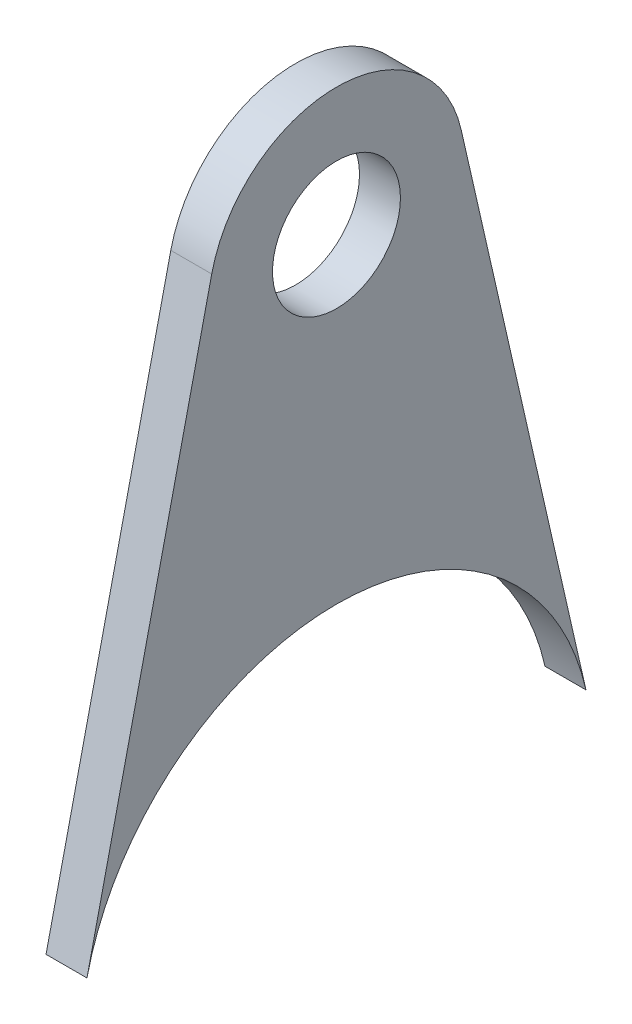
ISO-10303-21;
HEADER;
FILE_DESCRIPTION(('STEP AP214'),'2;1');
FILE_NAME('part.step','',(''),(''),'','','');
FILE_SCHEMA(('AUTOMOTIVE_DESIGN { 1 0 10303 214 1 1 1 1 }'));
ENDSEC;
DATA;
#1=APPLICATION_CONTEXT('core data for automotive mechanical design processes');
#2=APPLICATION_PROTOCOL_DEFINITION('international standard','automotive_design',2000,#1);
#3=PRODUCT_CONTEXT('',#1,'mechanical');
#4=PRODUCT('Part','Part','',(#3));
#5=PRODUCT_RELATED_PRODUCT_CATEGORY('part','',(#4));
#6=PRODUCT_DEFINITION_FORMATION('','',#4);
#7=PRODUCT_DEFINITION_CONTEXT('part definition',#1,'design');
#8=PRODUCT_DEFINITION('design','',#6,#7);
#9=PRODUCT_DEFINITION_SHAPE('','',#8);
#10=(LENGTH_UNIT() NAMED_UNIT(*) SI_UNIT(.MILLI.,.METRE.));
#11=(NAMED_UNIT(*) PLANE_ANGLE_UNIT() SI_UNIT($,.RADIAN.));
#12=(NAMED_UNIT(*) SI_UNIT($,.STERADIAN.) SOLID_ANGLE_UNIT());
#13=UNCERTAINTY_MEASURE_WITH_UNIT(LENGTH_MEASURE(1.E-05),#10,'distance_accuracy_value','');
#14=(GEOMETRIC_REPRESENTATION_CONTEXT(3) GLOBAL_UNCERTAINTY_ASSIGNED_CONTEXT((#13)) GLOBAL_UNIT_ASSIGNED_CONTEXT((#10,
#11,#12)) REPRESENTATION_CONTEXT('',''));
#15=CARTESIAN_POINT('',(0.,0.,0.));
#16=DIRECTION('',(0.,0.,1.));
#17=DIRECTION('',(1.,0.,0.));
#18=AXIS2_PLACEMENT_3D('',#15,#16,#17);
#19=CARTESIAN_POINT('',(1.016,-12.7,0.));
#20=DIRECTION('',(-1.,0.,0.));
#21=DIRECTION('',(0.,0.,1.));
#22=AXIS2_PLACEMENT_3D('',#19,#20,#21);
#23=CYLINDRICAL_SURFACE('',#22,12.7);
#24=CARTESIAN_POINT('',(-1.016,-12.7,0.));
#25=DIRECTION('',(-1.,0.,0.));
#26=DIRECTION('',(0.,0.,-1.));
#27=AXIS2_PLACEMENT_3D('',#24,#25,#26);
#28=CIRCLE('',#27,12.7);
#29=CARTESIAN_POINT('',(-1.016,-9.87777777777778,12.3824497466533));
#30=VERTEX_POINT('',#29);
#31=CARTESIAN_POINT('',(-1.016,-9.87777777777778,-12.3824497466533));
#32=VERTEX_POINT('',#31);
#33=EDGE_CURVE('E111',#30,#32,#28,.T.);
#34=ORIENTED_EDGE('',*,*,#33,.T.);
#35=DIRECTION('',(-1.,0.,0.));
#36=VECTOR('',#35,1.);
#37=CARTESIAN_POINT('',(1.016,-9.87777777777778,-12.3824497466533));
#38=LINE('',#37,#36);
#39=CARTESIAN_POINT('',(1.016,-9.87777777777778,-12.3824497466533));
#40=VERTEX_POINT('',#39);
#41=EDGE_CURVE('E11',#40,#32,#38,.T.);
#42=ORIENTED_EDGE('',*,*,#41,.F.);
#43=CARTESIAN_POINT('',(1.016,-12.7,0.));
#44=DIRECTION('',(-1.,0.,0.));
#45=DIRECTION('',(0.,0.,-1.));
#46=AXIS2_PLACEMENT_3D('',#43,#44,#45);
#47=CIRCLE('',#46,12.7);
#48=CARTESIAN_POINT('',(1.016,-9.87777777777778,12.3824497466533));
#49=VERTEX_POINT('',#48);
#50=EDGE_CURVE('E95',#49,#40,#47,.T.);
#51=ORIENTED_EDGE('',*,*,#50,.F.);
#52=DIRECTION('',(-1.,0.,0.));
#53=VECTOR('',#52,1.);
#54=CARTESIAN_POINT('',(1.016,-9.87777777777778,12.3824497466533));
#55=LINE('',#54,#53);
#56=EDGE_CURVE('E107',#49,#30,#55,.T.);
#57=ORIENTED_EDGE('',*,*,#56,.T.);
#58=EDGE_LOOP('',(#34,#42,#51,#57));
#59=FACE_BOUND('',#58,.T.);
#60=ADVANCED_FACE('F43',(#59),#23,.F.);
#61=CARTESIAN_POINT('',(1.016,17.2861111111111,-6.19122487332666));
#62=DIRECTION('',(0.,-0.222222222222222,0.974996043043569));
#63=DIRECTION('',(0.,-0.974996043043569,-0.222222222222222));
#64=AXIS2_PLACEMENT_3D('',#61,#62,#63);
#65=PLANE('',#64);
#66=DIRECTION('',(0.,0.974996043043569,0.222222222222222));
#67=VECTOR('',#66,1.);
#68=CARTESIAN_POINT('',(-1.016,17.2861111111111,-6.19122487332666));
#69=LINE('',#68,#67);
#70=CARTESIAN_POINT('',(-1.016,17.2861111111111,-6.19122487332666));
#71=VERTEX_POINT('',#70);
#72=EDGE_CURVE('E100',#32,#71,#69,.T.);
#73=ORIENTED_EDGE('',*,*,#72,.T.);
#74=DIRECTION('',(-1.,0.,0.));
#75=VECTOR('',#74,1.);
#76=CARTESIAN_POINT('',(1.016,17.2861111111111,-6.19122487332666));
#77=LINE('',#76,#75);
#78=CARTESIAN_POINT('',(1.016,17.2861111111111,-6.19122487332666));
#79=VERTEX_POINT('',#78);
#80=EDGE_CURVE('E52',#79,#71,#77,.T.);
#81=ORIENTED_EDGE('',*,*,#80,.F.);
#82=DIRECTION('',(0.,0.974996043043569,0.222222222222222));
#83=VECTOR('',#82,1.);
#84=CARTESIAN_POINT('',(1.016,17.2861111111111,-6.19122487332666));
#85=LINE('',#84,#83);
#86=EDGE_CURVE('E90',#40,#79,#85,.T.);
#87=ORIENTED_EDGE('',*,*,#86,.F.);
#88=ORIENTED_EDGE('',*,*,#41,.T.);
#89=EDGE_LOOP('',(#73,#81,#87,#88));
#90=FACE_BOUND('',#89,.T.);
#91=ADVANCED_FACE('F99',(#90),#65,.F.);
#92=CARTESIAN_POINT('',(1.016,15.875,0.));
#93=DIRECTION('',(-1.,0.,0.));
#94=DIRECTION('',(0.,0.,1.));
#95=AXIS2_PLACEMENT_3D('',#92,#93,#94);
#96=CYLINDRICAL_SURFACE('',#95,6.35);
#97=CARTESIAN_POINT('',(-1.016,15.875,0.));
#98=DIRECTION('',(1.,0.,0.));
#99=DIRECTION('',(0.,0.,-1.));
#100=AXIS2_PLACEMENT_3D('',#97,#98,#99);
#101=CIRCLE('',#100,6.35);
#102=CARTESIAN_POINT('',(-1.016,17.2861111111111,6.19122487332666));
#103=VERTEX_POINT('',#102);
#104=EDGE_CURVE('E77',#71,#103,#101,.T.);
#105=ORIENTED_EDGE('',*,*,#104,.T.);
#106=DIRECTION('',(-1.,0.,0.));
#107=VECTOR('',#106,1.);
#108=CARTESIAN_POINT('',(1.016,17.2861111111111,6.19122487332666));
#109=LINE('',#108,#107);
#110=CARTESIAN_POINT('',(1.016,17.2861111111111,6.19122487332666));
#111=VERTEX_POINT('',#110);
#112=EDGE_CURVE('E102',#111,#103,#109,.T.);
#113=ORIENTED_EDGE('',*,*,#112,.F.);
#114=CARTESIAN_POINT('',(1.016,15.875,0.));
#115=DIRECTION('',(1.,0.,0.));
#116=DIRECTION('',(0.,0.,-1.));
#117=AXIS2_PLACEMENT_3D('',#114,#115,#116);
#118=CIRCLE('',#117,6.35);
#119=EDGE_CURVE('E93',#79,#111,#118,.T.);
#120=ORIENTED_EDGE('',*,*,#119,.F.);
#121=ORIENTED_EDGE('',*,*,#80,.T.);
#122=EDGE_LOOP('',(#105,#113,#120,#121));
#123=FACE_BOUND('',#122,.T.);
#124=ADVANCED_FACE('F103',(#123),#96,.T.);
#125=CARTESIAN_POINT('',(1.016,-9.87777777777778,12.3824497466533));
#126=DIRECTION('',(0.,-0.222222222222222,-0.974996043043569));
#127=DIRECTION('',(0.,0.974996043043569,-0.222222222222222));
#128=AXIS2_PLACEMENT_3D('',#125,#126,#127);
#129=PLANE('',#128);
#130=DIRECTION('',(0.,-0.974996043043569,0.222222222222222));
#131=VECTOR('',#130,1.);
#132=CARTESIAN_POINT('',(-1.016,-9.87777777777778,12.3824497466533));
#133=LINE('',#132,#131);
#134=EDGE_CURVE('E83',#103,#30,#133,.T.);
#135=ORIENTED_EDGE('',*,*,#134,.T.);
#136=ORIENTED_EDGE('',*,*,#56,.F.);
#137=DIRECTION('',(0.,-0.974996043043569,0.222222222222222));
#138=VECTOR('',#137,1.);
#139=CARTESIAN_POINT('',(1.016,-9.87777777777778,12.3824497466533));
#140=LINE('',#139,#138);
#141=EDGE_CURVE('E60',#111,#49,#140,.T.);
#142=ORIENTED_EDGE('',*,*,#141,.F.);
#143=ORIENTED_EDGE('',*,*,#112,.T.);
#144=EDGE_LOOP('',(#135,#136,#142,#143));
#145=FACE_BOUND('',#144,.T.);
#146=ADVANCED_FACE('F125',(#145),#129,.F.);
#147=CARTESIAN_POINT('',(1.016,-12.7,0.));
#148=DIRECTION('',(1.,0.,0.));
#149=DIRECTION('',(0.,0.,-1.));
#150=AXIS2_PLACEMENT_3D('',#147,#148,#149);
#151=PLANE('',#150);
#152=CARTESIAN_POINT('',(1.016,15.875,0.));
#153=DIRECTION('',(1.,0.,0.));
#154=DIRECTION('',(0.,0.,-1.));
#155=AXIS2_PLACEMENT_3D('',#152,#153,#154);
#156=CIRCLE('',#155,3.175);
#157=CARTESIAN_POINT('',(1.016,15.875,-3.175));
#158=VERTEX_POINT('',#157);
#159=EDGE_CURVE('E132',#158,#158,#156,.T.);
#160=ORIENTED_EDGE('',*,*,#159,.F.);
#161=EDGE_LOOP('',(#160));
#162=FACE_BOUND('',#161,.T.);
#163=ORIENTED_EDGE('',*,*,#50,.T.);
#164=ORIENTED_EDGE('',*,*,#86,.T.);
#165=ORIENTED_EDGE('',*,*,#119,.T.);
#166=ORIENTED_EDGE('',*,*,#141,.T.);
#167=EDGE_LOOP('',(#163,#164,#165,#166));
#168=FACE_BOUND('',#167,.T.);
#169=ADVANCED_FACE('F91',(#162,#168),#151,.T.);
#170=CARTESIAN_POINT('',(-1.016,-12.7,0.));
#171=DIRECTION('',(1.,0.,0.));
#172=DIRECTION('',(0.,0.,-1.));
#173=AXIS2_PLACEMENT_3D('',#170,#171,#172);
#174=PLANE('',#173);
#175=CARTESIAN_POINT('',(-1.016,15.875,0.));
#176=DIRECTION('',(1.,0.,0.));
#177=DIRECTION('',(0.,0.,-1.));
#178=AXIS2_PLACEMENT_3D('',#175,#176,#177);
#179=CIRCLE('',#178,3.175);
#180=CARTESIAN_POINT('',(-1.016,15.875,-3.175));
#181=VERTEX_POINT('',#180);
#182=EDGE_CURVE('E115',#181,#181,#179,.T.);
#183=ORIENTED_EDGE('',*,*,#182,.T.);
#184=EDGE_LOOP('',(#183));
#185=FACE_BOUND('',#184,.T.);
#186=ORIENTED_EDGE('',*,*,#33,.F.);
#187=ORIENTED_EDGE('',*,*,#134,.F.);
#188=ORIENTED_EDGE('',*,*,#104,.F.);
#189=ORIENTED_EDGE('',*,*,#72,.F.);
#190=EDGE_LOOP('',(#186,#187,#188,#189));
#191=FACE_BOUND('',#190,.T.);
#192=ADVANCED_FACE('F128',(#185,#191),#174,.F.);
#193=CARTESIAN_POINT('',(-1.016,15.875,0.));
#194=DIRECTION('',(1.,0.,0.));
#195=DIRECTION('',(0.,0.,-1.));
#196=AXIS2_PLACEMENT_3D('',#193,#194,#195);
#197=CYLINDRICAL_SURFACE('',#196,3.175);
#198=ORIENTED_EDGE('',*,*,#182,.F.);
#199=EDGE_LOOP('',(#198));
#200=FACE_BOUND('',#199,.T.);
#201=ORIENTED_EDGE('',*,*,#159,.T.);
#202=EDGE_LOOP('',(#201));
#203=FACE_BOUND('',#202,.T.);
#204=ADVANCED_FACE('F141',(#200,#203),#197,.F.);
#205=CLOSED_SHELL('',(#60,#91,#124,#146,#169,#192,#204));
#206=MANIFOLD_SOLID_BREP('B2',#205);
#207=ADVANCED_BREP_SHAPE_REPRESENTATION('',(#18,#206),#14);
#208=SHAPE_DEFINITION_REPRESENTATION(#9,#207);
ENDSEC;
END-ISO-10303-21;
